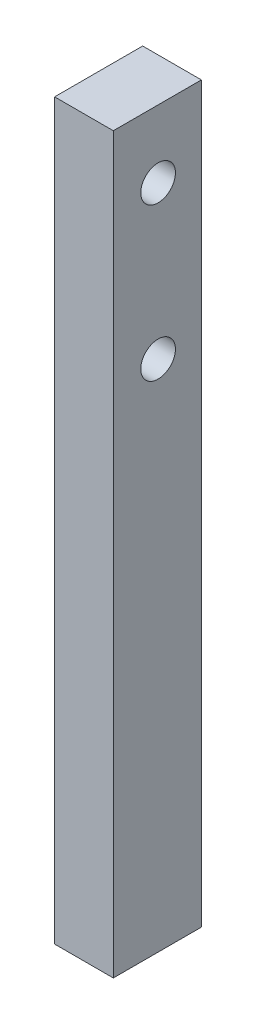
ISO-10303-21;
HEADER;
FILE_DESCRIPTION(('STEP AP214'),'2;1');
FILE_NAME('part.step','',(''),(''),'','','');
FILE_SCHEMA(('AUTOMOTIVE_DESIGN { 1 0 10303 214 1 1 1 1 }'));
ENDSEC;
DATA;
#1=APPLICATION_CONTEXT('core data for automotive mechanical design processes');
#2=APPLICATION_PROTOCOL_DEFINITION('international standard','automotive_design',2000,#1);
#3=PRODUCT_CONTEXT('',#1,'mechanical');
#4=PRODUCT('Part','Part','',(#3));
#5=PRODUCT_RELATED_PRODUCT_CATEGORY('part','',(#4));
#6=PRODUCT_DEFINITION_FORMATION('','',#4);
#7=PRODUCT_DEFINITION_CONTEXT('part definition',#1,'design');
#8=PRODUCT_DEFINITION('design','',#6,#7);
#9=PRODUCT_DEFINITION_SHAPE('','',#8);
#10=(LENGTH_UNIT() NAMED_UNIT(*) SI_UNIT(.MILLI.,.METRE.));
#11=(NAMED_UNIT(*) PLANE_ANGLE_UNIT() SI_UNIT($,.RADIAN.));
#12=(NAMED_UNIT(*) SI_UNIT($,.STERADIAN.) SOLID_ANGLE_UNIT());
#13=UNCERTAINTY_MEASURE_WITH_UNIT(LENGTH_MEASURE(1.E-05),#10,'distance_accuracy_value','');
#14=(GEOMETRIC_REPRESENTATION_CONTEXT(3) GLOBAL_UNCERTAINTY_ASSIGNED_CONTEXT((#13)) GLOBAL_UNIT_ASSIGNED_CONTEXT((#10,
#11,#12)) REPRESENTATION_CONTEXT('',''));
#15=CARTESIAN_POINT('',(0.,0.,0.));
#16=DIRECTION('',(0.,0.,1.));
#17=DIRECTION('',(1.,0.,0.));
#18=AXIS2_PLACEMENT_3D('',#15,#16,#17);
#19=CARTESIAN_POINT('',(0.,0.,7.62));
#20=DIRECTION('',(1.,0.,0.));
#21=DIRECTION('',(0.,0.,-1.));
#22=AXIS2_PLACEMENT_3D('',#19,#20,#21);
#23=PLANE('',#22);
#24=CARTESIAN_POINT('',(0.,57.658,3.74449984707326));
#25=DIRECTION('',(-1.,0.,0.));
#26=DIRECTION('',(0.,0.,1.));
#27=AXIS2_PLACEMENT_3D('',#24,#25,#26);
#28=CIRCLE('',#27,1.5);
#29=CARTESIAN_POINT('',(0.,57.658,5.24449984707326));
#30=VERTEX_POINT('',#29);
#31=EDGE_CURVE('E116',#30,#30,#28,.T.);
#32=ORIENTED_EDGE('',*,*,#31,.F.);
#33=EDGE_LOOP('',(#32));
#34=FACE_BOUND('',#33,.T.);
#35=CARTESIAN_POINT('',(0.,44.45,3.74449984707326));
#36=DIRECTION('',(-1.,0.,0.));
#37=DIRECTION('',(0.,0.,1.));
#38=AXIS2_PLACEMENT_3D('',#35,#36,#37);
#39=CIRCLE('',#38,1.5);
#40=CARTESIAN_POINT('',(0.,44.45,5.24449984707326));
#41=VERTEX_POINT('',#40);
#42=EDGE_CURVE('E110',#41,#41,#39,.T.);
#43=ORIENTED_EDGE('',*,*,#42,.F.);
#44=EDGE_LOOP('',(#43));
#45=FACE_BOUND('',#44,.T.);
#46=DIRECTION('',(0.,-1.,0.));
#47=VECTOR('',#46,1.);
#48=CARTESIAN_POINT('',(0.,0.,0.));
#49=LINE('',#48,#47);
#50=CARTESIAN_POINT('',(0.,63.5,0.));
#51=VERTEX_POINT('',#50);
#52=CARTESIAN_POINT('',(0.,0.,0.));
#53=VERTEX_POINT('',#52);
#54=EDGE_CURVE('E96',#51,#53,#49,.T.);
#55=ORIENTED_EDGE('',*,*,#54,.T.);
#56=DIRECTION('',(0.,0.,-1.));
#57=VECTOR('',#56,1.);
#58=CARTESIAN_POINT('',(0.,0.,7.62));
#59=LINE('',#58,#57);
#60=CARTESIAN_POINT('',(0.,0.,7.62));
#61=VERTEX_POINT('',#60);
#62=EDGE_CURVE('E11',#61,#53,#59,.T.);
#63=ORIENTED_EDGE('',*,*,#62,.F.);
#64=DIRECTION('',(0.,-1.,0.));
#65=VECTOR('',#64,1.);
#66=CARTESIAN_POINT('',(0.,0.,7.62));
#67=LINE('',#66,#65);
#68=CARTESIAN_POINT('',(0.,63.5,7.62));
#69=VERTEX_POINT('',#68);
#70=EDGE_CURVE('E84',#69,#61,#67,.T.);
#71=ORIENTED_EDGE('',*,*,#70,.F.);
#72=DIRECTION('',(0.,0.,-1.));
#73=VECTOR('',#72,1.);
#74=CARTESIAN_POINT('',(0.,63.5,7.62));
#75=LINE('',#74,#73);
#76=EDGE_CURVE('E92',#69,#51,#75,.T.);
#77=ORIENTED_EDGE('',*,*,#76,.T.);
#78=EDGE_LOOP('',(#55,#63,#71,#77));
#79=FACE_BOUND('',#78,.T.);
#80=ADVANCED_FACE('F33',(#34,#45,#79),#23,.F.);
#81=CARTESIAN_POINT('',(0.,0.,7.62));
#82=DIRECTION('',(0.,1.,0.));
#83=DIRECTION('',(0.,0.,1.));
#84=AXIS2_PLACEMENT_3D('',#81,#82,#83);
#85=PLANE('',#84);
#86=DIRECTION('',(1.,0.,0.));
#87=VECTOR('',#86,1.);
#88=CARTESIAN_POINT('',(0.,0.,0.));
#89=LINE('',#88,#87);
#90=CARTESIAN_POINT('',(5.08,0.,0.));
#91=VERTEX_POINT('',#90);
#92=EDGE_CURVE('E88',#53,#91,#89,.T.);
#93=ORIENTED_EDGE('',*,*,#92,.T.);
#94=DIRECTION('',(0.,0.,-1.));
#95=VECTOR('',#94,1.);
#96=CARTESIAN_POINT('',(5.08,0.,7.62));
#97=LINE('',#96,#95);
#98=CARTESIAN_POINT('',(5.08,0.,7.62));
#99=VERTEX_POINT('',#98);
#100=EDGE_CURVE('E41',#99,#91,#97,.T.);
#101=ORIENTED_EDGE('',*,*,#100,.F.);
#102=DIRECTION('',(1.,0.,0.));
#103=VECTOR('',#102,1.);
#104=CARTESIAN_POINT('',(0.,0.,7.62));
#105=LINE('',#104,#103);
#106=EDGE_CURVE('E79',#61,#99,#105,.T.);
#107=ORIENTED_EDGE('',*,*,#106,.F.);
#108=ORIENTED_EDGE('',*,*,#62,.T.);
#109=EDGE_LOOP('',(#93,#101,#107,#108));
#110=FACE_BOUND('',#109,.T.);
#111=ADVANCED_FACE('F87',(#110),#85,.F.);
#112=CARTESIAN_POINT('',(5.08,0.,7.62));
#113=DIRECTION('',(-1.,0.,0.));
#114=DIRECTION('',(0.,0.,1.));
#115=AXIS2_PLACEMENT_3D('',#112,#113,#114);
#116=PLANE('',#115);
#117=CARTESIAN_POINT('',(5.08,57.658,3.74449984707326));
#118=DIRECTION('',(-1.,0.,0.));
#119=DIRECTION('',(0.,0.,1.));
#120=AXIS2_PLACEMENT_3D('',#117,#118,#119);
#121=CIRCLE('',#120,1.5);
#122=CARTESIAN_POINT('',(5.08,57.658,5.24449984707326));
#123=VERTEX_POINT('',#122);
#124=EDGE_CURVE('E99',#123,#123,#121,.T.);
#125=ORIENTED_EDGE('',*,*,#124,.T.);
#126=EDGE_LOOP('',(#125));
#127=FACE_BOUND('',#126,.T.);
#128=CARTESIAN_POINT('',(5.08,44.45,3.74449984707326));
#129=DIRECTION('',(-1.,0.,0.));
#130=DIRECTION('',(0.,0.,1.));
#131=AXIS2_PLACEMENT_3D('',#128,#129,#130);
#132=CIRCLE('',#131,1.5);
#133=CARTESIAN_POINT('',(5.08,44.45,5.24449984707326));
#134=VERTEX_POINT('',#133);
#135=EDGE_CURVE('E113',#134,#134,#132,.T.);
#136=ORIENTED_EDGE('',*,*,#135,.T.);
#137=EDGE_LOOP('',(#136));
#138=FACE_BOUND('',#137,.T.);
#139=DIRECTION('',(0.,1.,0.));
#140=VECTOR('',#139,1.);
#141=CARTESIAN_POINT('',(5.08,0.,0.));
#142=LINE('',#141,#140);
#143=CARTESIAN_POINT('',(5.08,63.5,0.));
#144=VERTEX_POINT('',#143);
#145=EDGE_CURVE('E66',#91,#144,#142,.T.);
#146=ORIENTED_EDGE('',*,*,#145,.T.);
#147=DIRECTION('',(0.,0.,-1.));
#148=VECTOR('',#147,1.);
#149=CARTESIAN_POINT('',(5.08,63.5,7.62));
#150=LINE('',#149,#148);
#151=CARTESIAN_POINT('',(5.08,63.5,7.62));
#152=VERTEX_POINT('',#151);
#153=EDGE_CURVE('E89',#152,#144,#150,.T.);
#154=ORIENTED_EDGE('',*,*,#153,.F.);
#155=DIRECTION('',(0.,1.,0.));
#156=VECTOR('',#155,1.);
#157=CARTESIAN_POINT('',(5.08,0.,7.62));
#158=LINE('',#157,#156);
#159=EDGE_CURVE('E82',#99,#152,#158,.T.);
#160=ORIENTED_EDGE('',*,*,#159,.F.);
#161=ORIENTED_EDGE('',*,*,#100,.T.);
#162=EDGE_LOOP('',(#146,#154,#160,#161));
#163=FACE_BOUND('',#162,.T.);
#164=ADVANCED_FACE('F90',(#127,#138,#163),#116,.F.);
#165=CARTESIAN_POINT('',(0.,63.5,7.62));
#166=DIRECTION('',(0.,-1.,0.));
#167=DIRECTION('',(0.,0.,-1.));
#168=AXIS2_PLACEMENT_3D('',#165,#166,#167);
#169=PLANE('',#168);
#170=DIRECTION('',(-1.,0.,0.));
#171=VECTOR('',#170,1.);
#172=CARTESIAN_POINT('',(0.,63.5,0.));
#173=LINE('',#172,#171);
#174=EDGE_CURVE('E72',#144,#51,#173,.T.);
#175=ORIENTED_EDGE('',*,*,#174,.T.);
#176=ORIENTED_EDGE('',*,*,#76,.F.);
#177=DIRECTION('',(-1.,0.,0.));
#178=VECTOR('',#177,1.);
#179=CARTESIAN_POINT('',(0.,63.5,7.62));
#180=LINE('',#179,#178);
#181=EDGE_CURVE('E49',#152,#69,#180,.T.);
#182=ORIENTED_EDGE('',*,*,#181,.F.);
#183=ORIENTED_EDGE('',*,*,#153,.T.);
#184=EDGE_LOOP('',(#175,#176,#182,#183));
#185=FACE_BOUND('',#184,.T.);
#186=ADVANCED_FACE('F104',(#185),#169,.F.);
#187=CARTESIAN_POINT('',(0.,0.,7.62));
#188=DIRECTION('',(0.,0.,-1.));
#189=DIRECTION('',(-1.,0.,0.));
#190=AXIS2_PLACEMENT_3D('',#187,#188,#189);
#191=PLANE('',#190);
#192=ORIENTED_EDGE('',*,*,#70,.T.);
#193=ORIENTED_EDGE('',*,*,#106,.T.);
#194=ORIENTED_EDGE('',*,*,#159,.T.);
#195=ORIENTED_EDGE('',*,*,#181,.T.);
#196=EDGE_LOOP('',(#192,#193,#194,#195));
#197=FACE_BOUND('',#196,.T.);
#198=ADVANCED_FACE('F80',(#197),#191,.F.);
#199=CARTESIAN_POINT('',(0.,0.,0.));
#200=DIRECTION('',(0.,0.,-1.));
#201=DIRECTION('',(-1.,0.,0.));
#202=AXIS2_PLACEMENT_3D('',#199,#200,#201);
#203=PLANE('',#202);
#204=ORIENTED_EDGE('',*,*,#54,.F.);
#205=ORIENTED_EDGE('',*,*,#174,.F.);
#206=ORIENTED_EDGE('',*,*,#145,.F.);
#207=ORIENTED_EDGE('',*,*,#92,.F.);
#208=EDGE_LOOP('',(#204,#205,#206,#207));
#209=FACE_BOUND('',#208,.T.);
#210=ADVANCED_FACE('F107',(#209),#203,.T.);
#211=CARTESIAN_POINT('',(5.08,44.45,3.74449984707326));
#212=DIRECTION('',(-1.,0.,0.));
#213=DIRECTION('',(0.,0.,1.));
#214=AXIS2_PLACEMENT_3D('',#211,#212,#213);
#215=CYLINDRICAL_SURFACE('',#214,1.5);
#216=ORIENTED_EDGE('',*,*,#135,.F.);
#217=EDGE_LOOP('',(#216));
#218=FACE_BOUND('',#217,.T.);
#219=ORIENTED_EDGE('',*,*,#42,.T.);
#220=EDGE_LOOP('',(#219));
#221=FACE_BOUND('',#220,.T.);
#222=ADVANCED_FACE('F127',(#218,#221),#215,.F.);
#223=CARTESIAN_POINT('',(5.08,57.658,3.74449984707326));
#224=DIRECTION('',(-1.,0.,0.));
#225=DIRECTION('',(0.,0.,1.));
#226=AXIS2_PLACEMENT_3D('',#223,#224,#225);
#227=CYLINDRICAL_SURFACE('',#226,1.5);
#228=ORIENTED_EDGE('',*,*,#124,.F.);
#229=EDGE_LOOP('',(#228));
#230=FACE_BOUND('',#229,.T.);
#231=ORIENTED_EDGE('',*,*,#31,.T.);
#232=EDGE_LOOP('',(#231));
#233=FACE_BOUND('',#232,.T.);
#234=ADVANCED_FACE('F124',(#230,#233),#227,.F.);
#235=CLOSED_SHELL('',(#80,#111,#164,#186,#198,#210,#222,#234));
#236=MANIFOLD_SOLID_BREP('B2',#235);
#237=ADVANCED_BREP_SHAPE_REPRESENTATION('',(#18,#236),#14);
#238=SHAPE_DEFINITION_REPRESENTATION(#9,#237);
ENDSEC;
END-ISO-10303-21;
